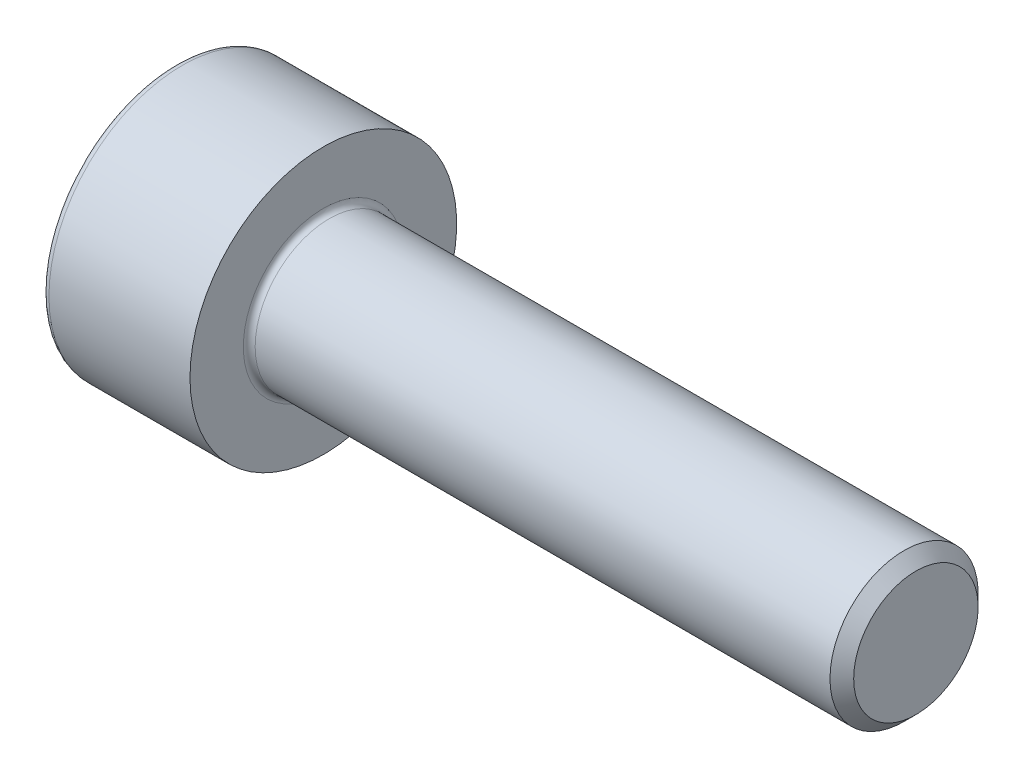
ISO-10303-21;
HEADER;
FILE_DESCRIPTION(('STEP AP214'),'2;1');
FILE_NAME('part.step','',(''),(''),'','','');
FILE_SCHEMA(('AUTOMOTIVE_DESIGN { 1 0 10303 214 1 1 1 1 }'));
ENDSEC;
DATA;
#1=APPLICATION_CONTEXT('core data for automotive mechanical design processes');
#2=APPLICATION_PROTOCOL_DEFINITION('international standard','automotive_design',2000,#1);
#3=PRODUCT_CONTEXT('',#1,'mechanical');
#4=PRODUCT('Part','Part','',(#3));
#5=PRODUCT_RELATED_PRODUCT_CATEGORY('part','',(#4));
#6=PRODUCT_DEFINITION_FORMATION('','',#4);
#7=PRODUCT_DEFINITION_CONTEXT('part definition',#1,'design');
#8=PRODUCT_DEFINITION('design','',#6,#7);
#9=PRODUCT_DEFINITION_SHAPE('','',#8);
#10=(LENGTH_UNIT() NAMED_UNIT(*) SI_UNIT(.MILLI.,.METRE.));
#11=(NAMED_UNIT(*) PLANE_ANGLE_UNIT() SI_UNIT($,.RADIAN.));
#12=(NAMED_UNIT(*) SI_UNIT($,.STERADIAN.) SOLID_ANGLE_UNIT());
#13=UNCERTAINTY_MEASURE_WITH_UNIT(LENGTH_MEASURE(1.E-05),#10,'distance_accuracy_value','');
#14=(GEOMETRIC_REPRESENTATION_CONTEXT(3) GLOBAL_UNCERTAINTY_ASSIGNED_CONTEXT((#13)) GLOBAL_UNIT_ASSIGNED_CONTEXT((#10,
#11,#12)) REPRESENTATION_CONTEXT('',''));
#15=CARTESIAN_POINT('',(0.,0.,0.));
#16=DIRECTION('',(0.,0.,1.));
#17=DIRECTION('',(1.,0.,0.));
#18=AXIS2_PLACEMENT_3D('',#15,#16,#17);
#19=CARTESIAN_POINT('',(12.5,0.,0.));
#20=DIRECTION('',(-1.,0.,0.));
#21=DIRECTION('',(0.,0.,1.));
#22=AXIS2_PLACEMENT_3D('',#19,#20,#21);
#23=PLANE('',#22);
#24=CARTESIAN_POINT('',(12.5,0.,0.));
#25=DIRECTION('',(-1.,0.,0.));
#26=DIRECTION('',(0.,0.,1.));
#27=AXIS2_PLACEMENT_3D('',#24,#25,#26);
#28=CIRCLE('',#27,1.05);
#29=CARTESIAN_POINT('',(12.5,0.,1.05));
#30=VERTEX_POINT('',#29);
#31=EDGE_CURVE('E11',#30,#30,#28,.F.);
#32=ORIENTED_EDGE('',*,*,#31,.T.);
#33=EDGE_LOOP('',(#32));
#34=FACE_BOUND('',#33,.T.);
#35=ADVANCED_FACE('F35',(#34),#23,.F.);
#36=CARTESIAN_POINT('',(0.,0.,0.));
#37=DIRECTION('',(-1.,0.,0.));
#38=DIRECTION('',(0.,0.,1.));
#39=AXIS2_PLACEMENT_3D('',#36,#37,#38);
#40=CYLINDRICAL_SURFACE('',#39,1.25);
#41=CARTESIAN_POINT('',(12.3,0.,0.));
#42=DIRECTION('',(-1.,0.,0.));
#43=DIRECTION('',(0.,0.,1.));
#44=AXIS2_PLACEMENT_3D('',#41,#42,#43);
#45=CIRCLE('',#44,1.25);
#46=CARTESIAN_POINT('',(12.3,0.,1.25));
#47=VERTEX_POINT('',#46);
#48=EDGE_CURVE('E43',#47,#47,#45,.T.);
#49=ORIENTED_EDGE('',*,*,#48,.T.);
#50=EDGE_LOOP('',(#49));
#51=FACE_BOUND('',#50,.T.);
#52=CARTESIAN_POINT('',(2.6,0.,0.));
#53=DIRECTION('',(1.,0.,0.));
#54=DIRECTION('',(0.,0.,-1.));
#55=AXIS2_PLACEMENT_3D('',#52,#53,#54);
#56=CIRCLE('',#55,1.25);
#57=CARTESIAN_POINT('',(2.6,0.,-1.25));
#58=VERTEX_POINT('',#57);
#59=EDGE_CURVE('E148',#58,#58,#56,.T.);
#60=ORIENTED_EDGE('',*,*,#59,.T.);
#61=EDGE_LOOP('',(#60));
#62=FACE_BOUND('',#61,.T.);
#63=ADVANCED_FACE('F159',(#51,#62),#40,.T.);
#64=CARTESIAN_POINT('',(2.5,0.,0.));
#65=DIRECTION('',(1.,0.,0.));
#66=DIRECTION('',(0.,0.,-1.));
#67=AXIS2_PLACEMENT_3D('',#64,#65,#66);
#68=PLANE('',#67);
#69=CARTESIAN_POINT('',(2.5,0.,0.));
#70=DIRECTION('',(1.,0.,0.));
#71=DIRECTION('',(0.,0.,-1.));
#72=AXIS2_PLACEMENT_3D('',#69,#70,#71);
#73=CIRCLE('',#72,1.35);
#74=CARTESIAN_POINT('',(2.5,0.,-1.35));
#75=VERTEX_POINT('',#74);
#76=EDGE_CURVE('E145',#75,#75,#73,.F.);
#77=ORIENTED_EDGE('',*,*,#76,.T.);
#78=EDGE_LOOP('',(#77));
#79=FACE_BOUND('',#78,.T.);
#80=CARTESIAN_POINT('',(2.5,0.,0.));
#81=DIRECTION('',(-1.,0.,0.));
#82=DIRECTION('',(0.,0.,1.));
#83=AXIS2_PLACEMENT_3D('',#80,#81,#82);
#84=CIRCLE('',#83,2.25);
#85=CARTESIAN_POINT('',(2.5,0.,2.25));
#86=VERTEX_POINT('',#85);
#87=EDGE_CURVE('E137',#86,#86,#84,.T.);
#88=ORIENTED_EDGE('',*,*,#87,.F.);
#89=EDGE_LOOP('',(#88));
#90=FACE_BOUND('',#89,.T.);
#91=ADVANCED_FACE('F181',(#79,#90),#68,.T.);
#92=CARTESIAN_POINT('',(0.,0.,0.));
#93=DIRECTION('',(-1.,0.,0.));
#94=DIRECTION('',(0.,0.,1.));
#95=AXIS2_PLACEMENT_3D('',#92,#93,#94);
#96=CYLINDRICAL_SURFACE('',#95,2.25);
#97=CARTESIAN_POINT('',(0.12,0.,0.));
#98=DIRECTION('',(-1.,0.,0.));
#99=DIRECTION('',(0.,0.,1.));
#100=AXIS2_PLACEMENT_3D('',#97,#98,#99);
#101=CIRCLE('',#100,2.25);
#102=CARTESIAN_POINT('',(0.12,0.,2.25));
#103=VERTEX_POINT('',#102);
#104=EDGE_CURVE('E154',#103,#103,#101,.F.);
#105=ORIENTED_EDGE('',*,*,#104,.T.);
#106=EDGE_LOOP('',(#105));
#107=FACE_BOUND('',#106,.T.);
#108=ORIENTED_EDGE('',*,*,#87,.T.);
#109=EDGE_LOOP('',(#108));
#110=FACE_BOUND('',#109,.T.);
#111=ADVANCED_FACE('F191',(#107,#110),#96,.T.);
#112=CARTESIAN_POINT('',(0.,0.,0.));
#113=DIRECTION('',(-1.,0.,0.));
#114=DIRECTION('',(0.,0.,1.));
#115=AXIS2_PLACEMENT_3D('',#112,#113,#114);
#116=PLANE('',#115);
#117=DIRECTION('',(0.,0.5,-0.866025403784439));
#118=VECTOR('',#117,1.);
#119=CARTESIAN_POINT('',(0.,0.577350269189626,0.999999999999999));
#120=LINE('',#119,#118);
#121=CARTESIAN_POINT('',(0.,0.577350269189626,0.999999999999999));
#122=VERTEX_POINT('',#121);
#123=CARTESIAN_POINT('',(0.,1.15470053837925,0.));
#124=VERTEX_POINT('',#123);
#125=EDGE_CURVE('E50',#122,#124,#120,.T.);
#126=ORIENTED_EDGE('',*,*,#125,.F.);
#127=DIRECTION('',(0.,1.,0.));
#128=VECTOR('',#127,1.);
#129=CARTESIAN_POINT('',(0.,-0.577350269189626,1.));
#130=LINE('',#129,#128);
#131=CARTESIAN_POINT('',(0.,-0.577350269189626,1.));
#132=VERTEX_POINT('',#131);
#133=EDGE_CURVE('E133',#132,#122,#130,.T.);
#134=ORIENTED_EDGE('',*,*,#133,.F.);
#135=DIRECTION('',(0.,0.5,0.866025403784439));
#136=VECTOR('',#135,1.);
#137=CARTESIAN_POINT('',(0.,-1.15470053837925,0.));
#138=LINE('',#137,#136);
#139=CARTESIAN_POINT('',(0.,-1.15470053837925,0.));
#140=VERTEX_POINT('',#139);
#141=EDGE_CURVE('E131',#140,#132,#138,.T.);
#142=ORIENTED_EDGE('',*,*,#141,.F.);
#143=DIRECTION('',(0.,-0.5,0.866025403784439));
#144=VECTOR('',#143,1.);
#145=CARTESIAN_POINT('',(0.,-0.577350269189626,-1.));
#146=LINE('',#145,#144);
#147=CARTESIAN_POINT('',(0.,-0.577350269189626,-1.));
#148=VERTEX_POINT('',#147);
#149=EDGE_CURVE('E98',#148,#140,#146,.T.);
#150=ORIENTED_EDGE('',*,*,#149,.F.);
#151=DIRECTION('',(0.,-1.,0.));
#152=VECTOR('',#151,1.);
#153=CARTESIAN_POINT('',(0.,0.577350269189626,-1.));
#154=LINE('',#153,#152);
#155=CARTESIAN_POINT('',(0.,0.577350269189626,-1.));
#156=VERTEX_POINT('',#155);
#157=EDGE_CURVE('E127',#156,#148,#154,.T.);
#158=ORIENTED_EDGE('',*,*,#157,.F.);
#159=DIRECTION('',(0.,-0.5,-0.866025403784438));
#160=VECTOR('',#159,1.);
#161=CARTESIAN_POINT('',(0.,1.15470053837925,0.));
#162=LINE('',#161,#160);
#163=EDGE_CURVE('E124',#124,#156,#162,.T.);
#164=ORIENTED_EDGE('',*,*,#163,.F.);
#165=EDGE_LOOP('',(#126,#134,#142,#150,#158,#164));
#166=FACE_BOUND('',#165,.T.);
#167=CARTESIAN_POINT('',(0.,0.,0.));
#168=DIRECTION('',(-1.,0.,0.));
#169=DIRECTION('',(0.,0.,1.));
#170=AXIS2_PLACEMENT_3D('',#167,#168,#169);
#171=CIRCLE('',#170,2.13);
#172=CARTESIAN_POINT('',(0.,0.,2.13));
#173=VERTEX_POINT('',#172);
#174=EDGE_CURVE('E151',#173,#173,#171,.T.);
#175=ORIENTED_EDGE('',*,*,#174,.T.);
#176=EDGE_LOOP('',(#175));
#177=FACE_BOUND('',#176,.T.);
#178=ADVANCED_FACE('F186',(#166,#177),#116,.T.);
#179=CARTESIAN_POINT('',(2.6,0.,0.));
#180=DIRECTION('',(1.,0.,0.));
#181=DIRECTION('',(0.,0.,-1.));
#182=AXIS2_PLACEMENT_3D('',#179,#180,#181);
#183=TOROIDAL_SURFACE('',#182,1.35,0.1);
#184=ORIENTED_EDGE('',*,*,#59,.F.);
#185=EDGE_LOOP('',(#184));
#186=FACE_BOUND('',#185,.T.);
#187=ORIENTED_EDGE('',*,*,#76,.F.);
#188=EDGE_LOOP('',(#187));
#189=FACE_BOUND('',#188,.T.);
#190=ADVANCED_FACE('F172',(#186,#189),#183,.F.);
#191=CARTESIAN_POINT('',(0.12,0.,0.));
#192=DIRECTION('',(-1.,0.,0.));
#193=DIRECTION('',(0.,0.,1.));
#194=AXIS2_PLACEMENT_3D('',#191,#192,#193);
#195=TOROIDAL_SURFACE('',#194,2.13,0.12);
#196=ORIENTED_EDGE('',*,*,#104,.F.);
#197=EDGE_LOOP('',(#196));
#198=FACE_BOUND('',#197,.T.);
#199=ORIENTED_EDGE('',*,*,#174,.F.);
#200=EDGE_LOOP('',(#199));
#201=FACE_BOUND('',#200,.T.);
#202=ADVANCED_FACE('F164',(#198,#201),#195,.T.);
#203=CARTESIAN_POINT('',(12.3,0.,0.));
#204=DIRECTION('',(-1.,0.,0.));
#205=DIRECTION('',(0.,0.,1.));
#206=AXIS2_PLACEMENT_3D('',#203,#204,#205);
#207=CONICAL_SURFACE('',#206,1.25,0.785398163397449);
#208=ORIENTED_EDGE('',*,*,#31,.F.);
#209=EDGE_LOOP('',(#208));
#210=FACE_BOUND('',#209,.T.);
#211=ORIENTED_EDGE('',*,*,#48,.F.);
#212=EDGE_LOOP('',(#211));
#213=FACE_BOUND('',#212,.T.);
#214=ADVANCED_FACE('F37',(#210,#213),#207,.T.);
#215=CARTESIAN_POINT('',(1.1,0.577350269189626,0.999999999999999));
#216=DIRECTION('',(0.,0.866025403784439,0.5));
#217=DIRECTION('',(0.,-0.5,0.866025403784439));
#218=AXIS2_PLACEMENT_3D('',#215,#216,#217);
#219=PLANE('',#218);
#220=ORIENTED_EDGE('',*,*,#125,.T.);
#221=DIRECTION('',(-1.,0.,0.));
#222=VECTOR('',#221,1.);
#223=CARTESIAN_POINT('',(1.1,1.15470053837925,0.));
#224=LINE('',#223,#222);
#225=CARTESIAN_POINT('',(1.1,1.15470053837925,0.));
#226=VERTEX_POINT('',#225);
#227=EDGE_CURVE('E80',#226,#124,#224,.T.);
#228=ORIENTED_EDGE('',*,*,#227,.F.);
#229=DIRECTION('',(0.,0.5,-0.866025403784439));
#230=VECTOR('',#229,1.);
#231=CARTESIAN_POINT('',(1.1,0.577350269189626,0.999999999999999));
#232=LINE('',#231,#230);
#233=CARTESIAN_POINT('',(1.1,0.577350269189626,0.999999999999999));
#234=VERTEX_POINT('',#233);
#235=EDGE_CURVE('E135',#234,#226,#232,.T.);
#236=ORIENTED_EDGE('',*,*,#235,.F.);
#237=DIRECTION('',(-1.,0.,0.));
#238=VECTOR('',#237,1.);
#239=CARTESIAN_POINT('',(1.1,0.577350269189626,0.999999999999999));
#240=LINE('',#239,#238);
#241=EDGE_CURVE('E58',#234,#122,#240,.T.);
#242=ORIENTED_EDGE('',*,*,#241,.T.);
#243=EDGE_LOOP('',(#220,#228,#236,#242));
#244=FACE_BOUND('',#243,.T.);
#245=ADVANCED_FACE('F163',(#244),#219,.F.);
#246=CARTESIAN_POINT('',(1.1,-0.577350269189626,1.));
#247=DIRECTION('',(0.,0.,1.));
#248=DIRECTION('',(0.,-1.,0.));
#249=AXIS2_PLACEMENT_3D('',#246,#247,#248);
#250=PLANE('',#249);
#251=ORIENTED_EDGE('',*,*,#133,.T.);
#252=ORIENTED_EDGE('',*,*,#241,.F.);
#253=DIRECTION('',(0.,1.,0.));
#254=VECTOR('',#253,1.);
#255=CARTESIAN_POINT('',(1.1,-0.577350269189626,1.));
#256=LINE('',#255,#254);
#257=CARTESIAN_POINT('',(1.1,-0.577350269189626,1.));
#258=VERTEX_POINT('',#257);
#259=EDGE_CURVE('E110',#258,#234,#256,.T.);
#260=ORIENTED_EDGE('',*,*,#259,.F.);
#261=DIRECTION('',(-1.,0.,0.));
#262=VECTOR('',#261,1.);
#263=CARTESIAN_POINT('',(1.1,-0.577350269189626,1.));
#264=LINE('',#263,#262);
#265=EDGE_CURVE('E102',#258,#132,#264,.T.);
#266=ORIENTED_EDGE('',*,*,#265,.T.);
#267=EDGE_LOOP('',(#251,#252,#260,#266));
#268=FACE_BOUND('',#267,.T.);
#269=ADVANCED_FACE('F170',(#268),#250,.F.);
#270=CARTESIAN_POINT('',(1.1,-1.15470053837925,0.));
#271=DIRECTION('',(0.,-0.866025403784439,0.5));
#272=DIRECTION('',(0.,-0.5,-0.866025403784439));
#273=AXIS2_PLACEMENT_3D('',#270,#271,#272);
#274=PLANE('',#273);
#275=ORIENTED_EDGE('',*,*,#141,.T.);
#276=ORIENTED_EDGE('',*,*,#265,.F.);
#277=DIRECTION('',(0.,0.5,0.866025403784439));
#278=VECTOR('',#277,1.);
#279=CARTESIAN_POINT('',(1.1,-1.15470053837925,0.));
#280=LINE('',#279,#278);
#281=CARTESIAN_POINT('',(1.1,-1.15470053837925,0.));
#282=VERTEX_POINT('',#281);
#283=EDGE_CURVE('E106',#282,#258,#280,.T.);
#284=ORIENTED_EDGE('',*,*,#283,.F.);
#285=DIRECTION('',(-1.,0.,0.));
#286=VECTOR('',#285,1.);
#287=CARTESIAN_POINT('',(1.1,-1.15470053837925,0.));
#288=LINE('',#287,#286);
#289=EDGE_CURVE('E91',#282,#140,#288,.T.);
#290=ORIENTED_EDGE('',*,*,#289,.T.);
#291=EDGE_LOOP('',(#275,#276,#284,#290));
#292=FACE_BOUND('',#291,.T.);
#293=ADVANCED_FACE('F107',(#292),#274,.F.);
#294=CARTESIAN_POINT('',(1.1,-0.577350269189626,-1.));
#295=DIRECTION('',(0.,-0.866025403784439,-0.5));
#296=DIRECTION('',(0.,0.5,-0.866025403784439));
#297=AXIS2_PLACEMENT_3D('',#294,#295,#296);
#298=PLANE('',#297);
#299=ORIENTED_EDGE('',*,*,#149,.T.);
#300=ORIENTED_EDGE('',*,*,#289,.F.);
#301=DIRECTION('',(0.,-0.5,0.866025403784439));
#302=VECTOR('',#301,1.);
#303=CARTESIAN_POINT('',(1.1,-0.577350269189626,-1.));
#304=LINE('',#303,#302);
#305=CARTESIAN_POINT('',(1.1,-0.577350269189626,-1.));
#306=VERTEX_POINT('',#305);
#307=EDGE_CURVE('E95',#306,#282,#304,.T.);
#308=ORIENTED_EDGE('',*,*,#307,.F.);
#309=DIRECTION('',(-1.,0.,0.));
#310=VECTOR('',#309,1.);
#311=CARTESIAN_POINT('',(1.1,-0.577350269189626,-1.));
#312=LINE('',#311,#310);
#313=EDGE_CURVE('E103',#306,#148,#312,.T.);
#314=ORIENTED_EDGE('',*,*,#313,.T.);
#315=EDGE_LOOP('',(#299,#300,#308,#314));
#316=FACE_BOUND('',#315,.T.);
#317=ADVANCED_FACE('F93',(#316),#298,.F.);
#318=CARTESIAN_POINT('',(1.1,0.577350269189626,-1.));
#319=DIRECTION('',(0.,0.,-1.));
#320=DIRECTION('',(0.,1.,0.));
#321=AXIS2_PLACEMENT_3D('',#318,#319,#320);
#322=PLANE('',#321);
#323=ORIENTED_EDGE('',*,*,#157,.T.);
#324=ORIENTED_EDGE('',*,*,#313,.F.);
#325=DIRECTION('',(0.,-1.,0.));
#326=VECTOR('',#325,1.);
#327=CARTESIAN_POINT('',(1.1,0.577350269189626,-1.));
#328=LINE('',#327,#326);
#329=CARTESIAN_POINT('',(1.1,0.577350269189626,-1.));
#330=VERTEX_POINT('',#329);
#331=EDGE_CURVE('E116',#330,#306,#328,.T.);
#332=ORIENTED_EDGE('',*,*,#331,.F.);
#333=DIRECTION('',(-1.,0.,0.));
#334=VECTOR('',#333,1.);
#335=CARTESIAN_POINT('',(1.1,0.577350269189626,-1.));
#336=LINE('',#335,#334);
#337=EDGE_CURVE('E140',#330,#156,#336,.T.);
#338=ORIENTED_EDGE('',*,*,#337,.T.);
#339=EDGE_LOOP('',(#323,#324,#332,#338));
#340=FACE_BOUND('',#339,.T.);
#341=ADVANCED_FACE('F211',(#340),#322,.F.);
#342=CARTESIAN_POINT('',(1.1,1.15470053837925,0.));
#343=DIRECTION('',(0.,0.866025403784438,-0.5));
#344=DIRECTION('',(0.,0.5,0.866025403784439));
#345=AXIS2_PLACEMENT_3D('',#342,#343,#344);
#346=PLANE('',#345);
#347=ORIENTED_EDGE('',*,*,#163,.T.);
#348=ORIENTED_EDGE('',*,*,#337,.F.);
#349=DIRECTION('',(0.,-0.5,-0.866025403784438));
#350=VECTOR('',#349,1.);
#351=CARTESIAN_POINT('',(1.1,1.15470053837925,0.));
#352=LINE('',#351,#350);
#353=EDGE_CURVE('E118',#226,#330,#352,.T.);
#354=ORIENTED_EDGE('',*,*,#353,.F.);
#355=ORIENTED_EDGE('',*,*,#227,.T.);
#356=EDGE_LOOP('',(#347,#348,#354,#355));
#357=FACE_BOUND('',#356,.T.);
#358=ADVANCED_FACE('F208',(#357),#346,.F.);
#359=CARTESIAN_POINT('',(1.1,0.,0.));
#360=DIRECTION('',(-1.,0.,0.));
#361=DIRECTION('',(0.,0.,1.));
#362=AXIS2_PLACEMENT_3D('',#359,#360,#361);
#363=PLANE('',#362);
#364=ORIENTED_EDGE('',*,*,#235,.T.);
#365=ORIENTED_EDGE('',*,*,#353,.T.);
#366=ORIENTED_EDGE('',*,*,#331,.T.);
#367=ORIENTED_EDGE('',*,*,#307,.T.);
#368=ORIENTED_EDGE('',*,*,#283,.T.);
#369=ORIENTED_EDGE('',*,*,#259,.T.);
#370=EDGE_LOOP('',(#364,#365,#366,#367,#368,#369));
#371=FACE_BOUND('',#370,.T.);
#372=ADVANCED_FACE('F113',(#371),#363,.T.);
#373=CLOSED_SHELL('',(#35,#63,#91,#111,#178,#190,#202,#214,#245,#269,#293,#317,#341,#358,#372));
#374=MANIFOLD_SOLID_BREP('B2',#373);
#375=ADVANCED_BREP_SHAPE_REPRESENTATION('',(#18,#374),#14);
#376=SHAPE_DEFINITION_REPRESENTATION(#9,#375);
ENDSEC;
END-ISO-10303-21;
